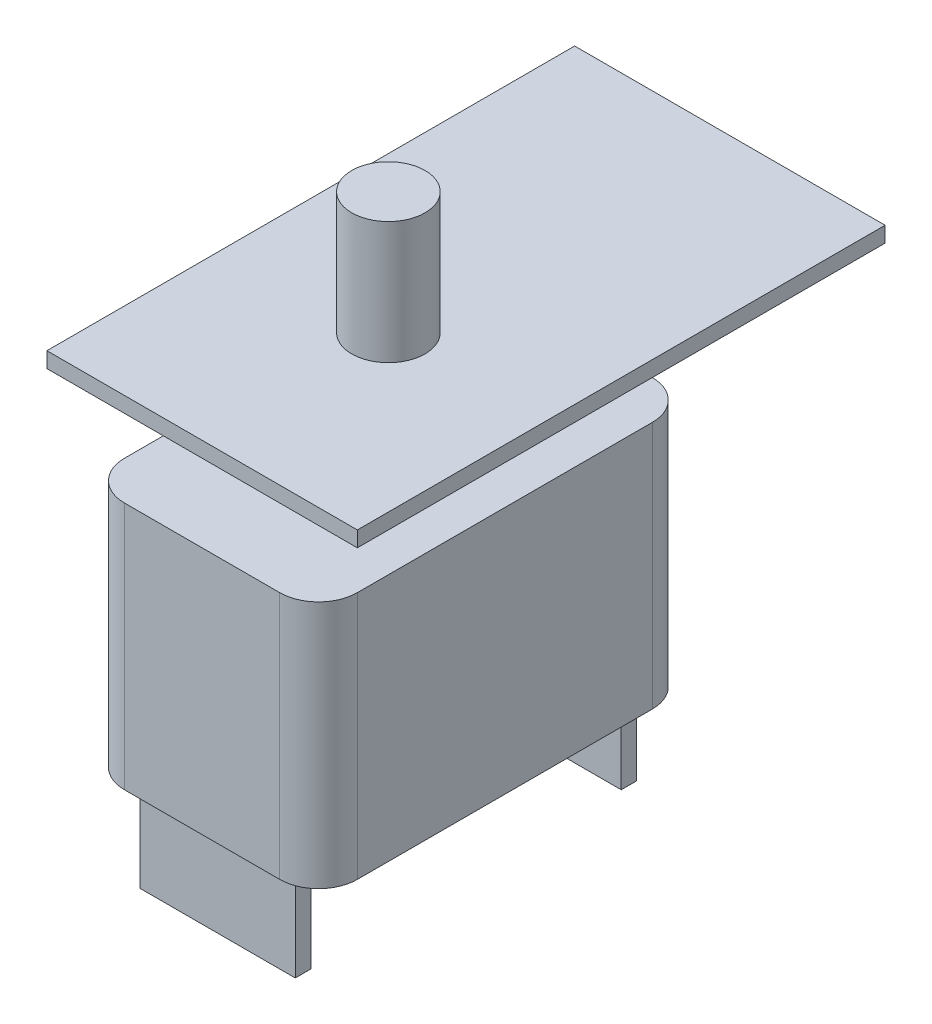
ISO-10303-21;
HEADER;
FILE_DESCRIPTION(('STEP AP214'),'2;1');
FILE_NAME('part.step','',(''),(''),'','','');
FILE_SCHEMA(('AUTOMOTIVE_DESIGN { 1 0 10303 214 1 1 1 1 }'));
ENDSEC;
DATA;
#1=APPLICATION_CONTEXT('core data for automotive mechanical design processes');
#2=APPLICATION_PROTOCOL_DEFINITION('international standard','automotive_design',2000,#1);
#3=PRODUCT_CONTEXT('',#1,'mechanical');
#4=PRODUCT('Part','Part','',(#3));
#5=PRODUCT_RELATED_PRODUCT_CATEGORY('part','',(#4));
#6=PRODUCT_DEFINITION_FORMATION('','',#4);
#7=PRODUCT_DEFINITION_CONTEXT('part definition',#1,'design');
#8=PRODUCT_DEFINITION('design','',#6,#7);
#9=PRODUCT_DEFINITION_SHAPE('','',#8);
#10=(LENGTH_UNIT() NAMED_UNIT(*) SI_UNIT(.MILLI.,.METRE.));
#11=(NAMED_UNIT(*) PLANE_ANGLE_UNIT() SI_UNIT($,.RADIAN.));
#12=(NAMED_UNIT(*) SI_UNIT($,.STERADIAN.) SOLID_ANGLE_UNIT());
#13=UNCERTAINTY_MEASURE_WITH_UNIT(LENGTH_MEASURE(1.E-05),#10,'distance_accuracy_value','');
#14=(GEOMETRIC_REPRESENTATION_CONTEXT(3) GLOBAL_UNCERTAINTY_ASSIGNED_CONTEXT((#13)) GLOBAL_UNIT_ASSIGNED_CONTEXT((#10,
#11,#12)) REPRESENTATION_CONTEXT('',''));
#15=CARTESIAN_POINT('',(0.,0.,0.));
#16=DIRECTION('',(0.,0.,1.));
#17=DIRECTION('',(1.,0.,0.));
#18=AXIS2_PLACEMENT_3D('',#15,#16,#17);
#19=CARTESIAN_POINT('',(0.,27.94,0.));
#20=DIRECTION('',(0.,-1.,0.));
#21=DIRECTION('',(0.,0.,-1.));
#22=AXIS2_PLACEMENT_3D('',#19,#20,#21);
#23=PLANE('',#22);
#24=DIRECTION('',(0.,0.,1.));
#25=VECTOR('',#24,1.);
#26=CARTESIAN_POINT('',(-12.7,27.94,-27.94));
#27=LINE('',#26,#25);
#28=CARTESIAN_POINT('',(-12.7,27.94,-27.94));
#29=VERTEX_POINT('',#28);
#30=CARTESIAN_POINT('',(-12.7,27.94,15.24));
#31=VERTEX_POINT('',#30);
#32=EDGE_CURVE('E179',#29,#31,#27,.T.);
#33=ORIENTED_EDGE('',*,*,#32,.T.);
#34=DIRECTION('',(1.,0.,0.));
#35=VECTOR('',#34,1.);
#36=CARTESIAN_POINT('',(12.7,27.94,15.24));
#37=LINE('',#36,#35);
#38=CARTESIAN_POINT('',(12.7,27.94,15.24));
#39=VERTEX_POINT('',#38);
#40=EDGE_CURVE('E168',#31,#39,#37,.T.);
#41=ORIENTED_EDGE('',*,*,#40,.T.);
#42=DIRECTION('',(0.,0.,-1.));
#43=VECTOR('',#42,1.);
#44=CARTESIAN_POINT('',(12.7,27.94,-27.94));
#45=LINE('',#44,#43);
#46=CARTESIAN_POINT('',(12.7,27.94,-27.94));
#47=VERTEX_POINT('',#46);
#48=EDGE_CURVE('E178',#39,#47,#45,.T.);
#49=ORIENTED_EDGE('',*,*,#48,.T.);
#50=DIRECTION('',(-1.,0.,0.));
#51=VECTOR('',#50,1.);
#52=CARTESIAN_POINT('',(12.7,27.94,-27.94));
#53=LINE('',#52,#51);
#54=EDGE_CURVE('E184',#47,#29,#53,.T.);
#55=ORIENTED_EDGE('',*,*,#54,.T.);
#56=EDGE_LOOP('',(#33,#41,#49,#55));
#57=FACE_BOUND('',#56,.T.);
#58=CARTESIAN_POINT('',(0.,27.94,0.));
#59=DIRECTION('',(0.,-1.,0.));
#60=DIRECTION('',(0.,0.,-1.));
#61=AXIS2_PLACEMENT_3D('',#58,#59,#60);
#62=CIRCLE('',#61,3.);
#63=CARTESIAN_POINT('',(0.,27.94,-3.));
#64=VERTEX_POINT('',#63);
#65=EDGE_CURVE('E11',#64,#64,#62,.F.);
#66=ORIENTED_EDGE('',*,*,#65,.F.);
#67=EDGE_LOOP('',(#66));
#68=FACE_BOUND('',#67,.T.);
#69=ADVANCED_FACE('F33',(#57,#68),#23,.F.);
#70=CARTESIAN_POINT('',(0.,0.,0.));
#71=DIRECTION('',(0.,1.,0.));
#72=DIRECTION('',(0.,0.,1.));
#73=AXIS2_PLACEMENT_3D('',#70,#71,#72);
#74=PLANE('',#73);
#75=DIRECTION('',(0.,0.,1.));
#76=VECTOR('',#75,1.);
#77=CARTESIAN_POINT('',(6.34999999999998,0.,13.97));
#78=LINE('',#77,#76);
#79=CARTESIAN_POINT('',(6.34999999999998,0.,12.7));
#80=VERTEX_POINT('',#79);
#81=CARTESIAN_POINT('',(6.34999999999998,0.,13.97));
#82=VERTEX_POINT('',#81);
#83=EDGE_CURVE('E226',#80,#82,#78,.T.);
#84=ORIENTED_EDGE('',*,*,#83,.F.);
#85=DIRECTION('',(1.,0.,0.));
#86=VECTOR('',#85,1.);
#87=CARTESIAN_POINT('',(-6.35000000000002,0.,12.7));
#88=LINE('',#87,#86);
#89=CARTESIAN_POINT('',(-6.35000000000002,0.,12.7));
#90=VERTEX_POINT('',#89);
#91=EDGE_CURVE('E231',#90,#80,#88,.T.);
#92=ORIENTED_EDGE('',*,*,#91,.F.);
#93=DIRECTION('',(0.,0.,-1.));
#94=VECTOR('',#93,1.);
#95=CARTESIAN_POINT('',(-6.35000000000002,0.,13.97));
#96=LINE('',#95,#94);
#97=CARTESIAN_POINT('',(-6.35000000000002,0.,13.97));
#98=VERTEX_POINT('',#97);
#99=EDGE_CURVE('E243',#98,#90,#96,.T.);
#100=ORIENTED_EDGE('',*,*,#99,.F.);
#101=DIRECTION('',(-1.,0.,0.));
#102=VECTOR('',#101,1.);
#103=CARTESIAN_POINT('',(-6.35000000000002,0.,13.97));
#104=LINE('',#103,#102);
#105=EDGE_CURVE('E240',#82,#98,#104,.T.);
#106=ORIENTED_EDGE('',*,*,#105,.F.);
#107=EDGE_LOOP('',(#84,#92,#100,#106));
#108=FACE_BOUND('',#107,.T.);
#109=DIRECTION('',(0.,0.,1.));
#110=VECTOR('',#109,1.);
#111=CARTESIAN_POINT('',(-9.525,0.,-15.24));
#112=LINE('',#111,#110);
#113=CARTESIAN_POINT('',(-9.525,0.,-12.065));
#114=VERTEX_POINT('',#113);
#115=CARTESIAN_POINT('',(-9.525,0.,12.065));
#116=VERTEX_POINT('',#115);
#117=EDGE_CURVE('E285',#114,#116,#112,.T.);
#118=ORIENTED_EDGE('',*,*,#117,.F.);
#119=CARTESIAN_POINT('',(-6.35,0.,-12.065));
#120=DIRECTION('',(0.,1.,0.));
#121=DIRECTION('',(0.,0.,1.));
#122=AXIS2_PLACEMENT_3D('',#119,#120,#121);
#123=CIRCLE('',#122,3.175);
#124=CARTESIAN_POINT('',(-6.35,0.,-15.24));
#125=VERTEX_POINT('',#124);
#126=EDGE_CURVE('E300',#114,#125,#123,.F.);
#127=ORIENTED_EDGE('',*,*,#126,.T.);
#128=DIRECTION('',(-1.,0.,0.));
#129=VECTOR('',#128,1.);
#130=CARTESIAN_POINT('',(-9.525,0.,-15.24));
#131=LINE('',#130,#129);
#132=CARTESIAN_POINT('',(6.34999999999999,0.,-15.24));
#133=VERTEX_POINT('',#132);
#134=EDGE_CURVE('E282',#133,#125,#131,.T.);
#135=ORIENTED_EDGE('',*,*,#134,.F.);
#136=CARTESIAN_POINT('',(6.35,0.,-12.065));
#137=DIRECTION('',(0.,1.,0.));
#138=DIRECTION('',(0.,0.,1.));
#139=AXIS2_PLACEMENT_3D('',#136,#137,#138);
#140=CIRCLE('',#139,3.175);
#141=CARTESIAN_POINT('',(9.525,0.,-12.065));
#142=VERTEX_POINT('',#141);
#143=EDGE_CURVE('E298',#133,#142,#140,.F.);
#144=ORIENTED_EDGE('',*,*,#143,.T.);
#145=DIRECTION('',(0.,0.,-1.));
#146=VECTOR('',#145,1.);
#147=CARTESIAN_POINT('',(9.525,0.,-15.24));
#148=LINE('',#147,#146);
#149=CARTESIAN_POINT('',(9.525,0.,12.065));
#150=VERTEX_POINT('',#149);
#151=EDGE_CURVE('E263',#150,#142,#148,.T.);
#152=ORIENTED_EDGE('',*,*,#151,.F.);
#153=CARTESIAN_POINT('',(6.35,0.,12.065));
#154=DIRECTION('',(0.,1.,0.));
#155=DIRECTION('',(0.,0.,1.));
#156=AXIS2_PLACEMENT_3D('',#153,#154,#155);
#157=CIRCLE('',#156,3.175);
#158=CARTESIAN_POINT('',(6.34999999999999,0.,15.24));
#159=VERTEX_POINT('',#158);
#160=EDGE_CURVE('E294',#150,#159,#157,.F.);
#161=ORIENTED_EDGE('',*,*,#160,.T.);
#162=DIRECTION('',(1.,0.,0.));
#163=VECTOR('',#162,1.);
#164=CARTESIAN_POINT('',(-9.525,0.,15.24));
#165=LINE('',#164,#163);
#166=CARTESIAN_POINT('',(-6.35,0.,15.24));
#167=VERTEX_POINT('',#166);
#168=EDGE_CURVE('E270',#167,#159,#165,.T.);
#169=ORIENTED_EDGE('',*,*,#168,.F.);
#170=CARTESIAN_POINT('',(-6.35,0.,12.065));
#171=DIRECTION('',(0.,1.,0.));
#172=DIRECTION('',(0.,0.,1.));
#173=AXIS2_PLACEMENT_3D('',#170,#171,#172);
#174=CIRCLE('',#173,3.175);
#175=EDGE_CURVE('E296',#167,#116,#174,.F.);
#176=ORIENTED_EDGE('',*,*,#175,.T.);
#177=EDGE_LOOP('',(#118,#127,#135,#144,#152,#161,#169,#176));
#178=FACE_BOUND('',#177,.T.);
#179=DIRECTION('',(0.,0.,-1.));
#180=VECTOR('',#179,1.);
#181=CARTESIAN_POINT('',(-6.35000000000002,0.,-13.97));
#182=LINE('',#181,#180);
#183=CARTESIAN_POINT('',(-6.35000000000002,0.,-12.7));
#184=VERTEX_POINT('',#183);
#185=CARTESIAN_POINT('',(-6.35000000000002,0.,-13.97));
#186=VERTEX_POINT('',#185);
#187=EDGE_CURVE('E193',#184,#186,#182,.T.);
#188=ORIENTED_EDGE('',*,*,#187,.F.);
#189=DIRECTION('',(-1.,0.,0.));
#190=VECTOR('',#189,1.);
#191=CARTESIAN_POINT('',(-6.35000000000002,0.,-12.7));
#192=LINE('',#191,#190);
#193=CARTESIAN_POINT('',(6.34999999999997,0.,-12.7));
#194=VERTEX_POINT('',#193);
#195=EDGE_CURVE('E205',#194,#184,#192,.T.);
#196=ORIENTED_EDGE('',*,*,#195,.F.);
#197=DIRECTION('',(0.,0.,1.));
#198=VECTOR('',#197,1.);
#199=CARTESIAN_POINT('',(6.34999999999997,0.,-13.97));
#200=LINE('',#199,#198);
#201=CARTESIAN_POINT('',(6.34999999999997,0.,-13.97));
#202=VERTEX_POINT('',#201);
#203=EDGE_CURVE('E53',#202,#194,#200,.T.);
#204=ORIENTED_EDGE('',*,*,#203,.F.);
#205=DIRECTION('',(1.,0.,0.));
#206=VECTOR('',#205,1.);
#207=CARTESIAN_POINT('',(-6.35000000000002,0.,-13.97));
#208=LINE('',#207,#206);
#209=EDGE_CURVE('E48',#186,#202,#208,.T.);
#210=ORIENTED_EDGE('',*,*,#209,.F.);
#211=EDGE_LOOP('',(#188,#196,#204,#210));
#212=FACE_BOUND('',#211,.T.);
#213=ADVANCED_FACE('F332',(#108,#178,#212),#74,.F.);
#214=CARTESIAN_POINT('',(0.,20.32,0.));
#215=DIRECTION('',(0.,1.,0.));
#216=DIRECTION('',(0.,0.,1.));
#217=AXIS2_PLACEMENT_3D('',#214,#215,#216);
#218=PLANE('',#217);
#219=DIRECTION('',(-1.,0.,0.));
#220=VECTOR('',#219,1.);
#221=CARTESIAN_POINT('',(-9.525,20.32,-15.24));
#222=LINE('',#221,#220);
#223=CARTESIAN_POINT('',(6.34999999999999,20.32,-15.24));
#224=VERTEX_POINT('',#223);
#225=CARTESIAN_POINT('',(-6.35,20.32,-15.24));
#226=VERTEX_POINT('',#225);
#227=EDGE_CURVE('E269',#224,#226,#222,.T.);
#228=ORIENTED_EDGE('',*,*,#227,.T.);
#229=CARTESIAN_POINT('',(-6.35,20.32,-12.065));
#230=DIRECTION('',(0.,1.,0.));
#231=DIRECTION('',(0.,0.,1.));
#232=AXIS2_PLACEMENT_3D('',#229,#230,#231);
#233=CIRCLE('',#232,3.175);
#234=CARTESIAN_POINT('',(-9.525,20.32,-12.065));
#235=VERTEX_POINT('',#234);
#236=EDGE_CURVE('E313',#226,#235,#233,.T.);
#237=ORIENTED_EDGE('',*,*,#236,.T.);
#238=DIRECTION('',(0.,0.,1.));
#239=VECTOR('',#238,1.);
#240=CARTESIAN_POINT('',(-9.525,20.32,-15.24));
#241=LINE('',#240,#239);
#242=CARTESIAN_POINT('',(-9.525,20.32,12.065));
#243=VERTEX_POINT('',#242);
#244=EDGE_CURVE('E273',#235,#243,#241,.T.);
#245=ORIENTED_EDGE('',*,*,#244,.T.);
#246=CARTESIAN_POINT('',(-6.35,20.32,12.065));
#247=DIRECTION('',(0.,1.,0.));
#248=DIRECTION('',(0.,0.,1.));
#249=AXIS2_PLACEMENT_3D('',#246,#247,#248);
#250=CIRCLE('',#249,3.175);
#251=CARTESIAN_POINT('',(-6.35,20.32,15.24));
#252=VERTEX_POINT('',#251);
#253=EDGE_CURVE('E309',#243,#252,#250,.T.);
#254=ORIENTED_EDGE('',*,*,#253,.T.);
#255=DIRECTION('',(1.,0.,0.));
#256=VECTOR('',#255,1.);
#257=CARTESIAN_POINT('',(-9.525,20.32,15.24));
#258=LINE('',#257,#256);
#259=CARTESIAN_POINT('',(6.34999999999999,20.32,15.24));
#260=VERTEX_POINT('',#259);
#261=EDGE_CURVE('E276',#252,#260,#258,.T.);
#262=ORIENTED_EDGE('',*,*,#261,.T.);
#263=CARTESIAN_POINT('',(6.35,20.32,12.065));
#264=DIRECTION('',(0.,1.,0.));
#265=DIRECTION('',(0.,0.,1.));
#266=AXIS2_PLACEMENT_3D('',#263,#264,#265);
#267=CIRCLE('',#266,3.175);
#268=CARTESIAN_POINT('',(9.525,20.32,12.065));
#269=VERTEX_POINT('',#268);
#270=EDGE_CURVE('E307',#260,#269,#267,.T.);
#271=ORIENTED_EDGE('',*,*,#270,.T.);
#272=DIRECTION('',(0.,0.,-1.));
#273=VECTOR('',#272,1.);
#274=CARTESIAN_POINT('',(9.525,20.32,-15.24));
#275=LINE('',#274,#273);
#276=CARTESIAN_POINT('',(9.525,20.32,-12.065));
#277=VERTEX_POINT('',#276);
#278=EDGE_CURVE('E266',#269,#277,#275,.T.);
#279=ORIENTED_EDGE('',*,*,#278,.T.);
#280=CARTESIAN_POINT('',(6.35,20.32,-12.065));
#281=DIRECTION('',(0.,1.,0.));
#282=DIRECTION('',(0.,0.,1.));
#283=AXIS2_PLACEMENT_3D('',#280,#281,#282);
#284=CIRCLE('',#283,3.175);
#285=EDGE_CURVE('E311',#277,#224,#284,.T.);
#286=ORIENTED_EDGE('',*,*,#285,.T.);
#287=EDGE_LOOP('',(#228,#237,#245,#254,#262,#271,#279,#286));
#288=FACE_BOUND('',#287,.T.);
#289=CARTESIAN_POINT('',(0.,20.32,0.));
#290=DIRECTION('',(0.,1.,0.));
#291=DIRECTION('',(0.,0.,1.));
#292=AXIS2_PLACEMENT_3D('',#289,#290,#291);
#293=CIRCLE('',#292,6.);
#294=CARTESIAN_POINT('',(0.,20.32,6.));
#295=VERTEX_POINT('',#294);
#296=EDGE_CURVE('E259',#295,#295,#293,.T.);
#297=ORIENTED_EDGE('',*,*,#296,.F.);
#298=EDGE_LOOP('',(#297));
#299=FACE_BOUND('',#298,.T.);
#300=ADVANCED_FACE('F343',(#288,#299),#218,.T.);
#301=CARTESIAN_POINT('',(9.525,20.32,-15.24));
#302=DIRECTION('',(-1.,0.,0.));
#303=DIRECTION('',(0.,0.,1.));
#304=AXIS2_PLACEMENT_3D('',#301,#302,#303);
#305=PLANE('',#304);
#306=ORIENTED_EDGE('',*,*,#151,.T.);
#307=DIRECTION('',(0.,-1.,0.));
#308=VECTOR('',#307,1.);
#309=CARTESIAN_POINT('',(9.525,20.32,-12.065));
#310=LINE('',#309,#308);
#311=EDGE_CURVE('E318',#142,#277,#310,.F.);
#312=ORIENTED_EDGE('',*,*,#311,.T.);
#313=ORIENTED_EDGE('',*,*,#278,.F.);
#314=DIRECTION('',(0.,-1.,0.));
#315=VECTOR('',#314,1.);
#316=CARTESIAN_POINT('',(9.525,20.32,12.065));
#317=LINE('',#316,#315);
#318=EDGE_CURVE('E315',#269,#150,#317,.T.);
#319=ORIENTED_EDGE('',*,*,#318,.T.);
#320=EDGE_LOOP('',(#306,#312,#313,#319));
#321=FACE_BOUND('',#320,.T.);
#322=ADVANCED_FACE('F339',(#321),#305,.F.);
#323=CARTESIAN_POINT('',(-9.525,20.32,-15.24));
#324=DIRECTION('',(0.,0.,1.));
#325=DIRECTION('',(1.,0.,0.));
#326=AXIS2_PLACEMENT_3D('',#323,#324,#325);
#327=PLANE('',#326);
#328=ORIENTED_EDGE('',*,*,#134,.T.);
#329=DIRECTION('',(0.,-1.,0.));
#330=VECTOR('',#329,1.);
#331=CARTESIAN_POINT('',(-6.35,20.32,-15.24));
#332=LINE('',#331,#330);
#333=EDGE_CURVE('E305',#125,#226,#332,.F.);
#334=ORIENTED_EDGE('',*,*,#333,.T.);
#335=ORIENTED_EDGE('',*,*,#227,.F.);
#336=DIRECTION('',(0.,-1.,0.));
#337=VECTOR('',#336,1.);
#338=CARTESIAN_POINT('',(6.35,20.32,-15.24));
#339=LINE('',#338,#337);
#340=EDGE_CURVE('E302',#224,#133,#339,.T.);
#341=ORIENTED_EDGE('',*,*,#340,.T.);
#342=EDGE_LOOP('',(#328,#334,#335,#341));
#343=FACE_BOUND('',#342,.T.);
#344=ADVANCED_FACE('F351',(#343),#327,.F.);
#345=CARTESIAN_POINT('',(-9.525,20.32,-15.24));
#346=DIRECTION('',(1.,0.,0.));
#347=DIRECTION('',(0.,0.,-1.));
#348=AXIS2_PLACEMENT_3D('',#345,#346,#347);
#349=PLANE('',#348);
#350=ORIENTED_EDGE('',*,*,#244,.F.);
#351=DIRECTION('',(0.,-1.,0.));
#352=VECTOR('',#351,1.);
#353=CARTESIAN_POINT('',(-9.525,20.32,-12.065));
#354=LINE('',#353,#352);
#355=EDGE_CURVE('E291',#235,#114,#354,.T.);
#356=ORIENTED_EDGE('',*,*,#355,.T.);
#357=ORIENTED_EDGE('',*,*,#117,.T.);
#358=DIRECTION('',(0.,-1.,0.));
#359=VECTOR('',#358,1.);
#360=CARTESIAN_POINT('',(-9.525,20.32,12.065));
#361=LINE('',#360,#359);
#362=EDGE_CURVE('E279',#116,#243,#361,.F.);
#363=ORIENTED_EDGE('',*,*,#362,.T.);
#364=EDGE_LOOP('',(#350,#356,#357,#363));
#365=FACE_BOUND('',#364,.T.);
#366=ADVANCED_FACE('F359',(#365),#349,.F.);
#367=CARTESIAN_POINT('',(-9.525,20.32,15.24));
#368=DIRECTION('',(0.,0.,-1.));
#369=DIRECTION('',(-1.,0.,0.));
#370=AXIS2_PLACEMENT_3D('',#367,#368,#369);
#371=PLANE('',#370);
#372=ORIENTED_EDGE('',*,*,#261,.F.);
#373=DIRECTION('',(0.,-1.,0.));
#374=VECTOR('',#373,1.);
#375=CARTESIAN_POINT('',(-6.35,20.32,15.24));
#376=LINE('',#375,#374);
#377=EDGE_CURVE('E41',#252,#167,#376,.T.);
#378=ORIENTED_EDGE('',*,*,#377,.T.);
#379=ORIENTED_EDGE('',*,*,#168,.T.);
#380=DIRECTION('',(0.,-1.,0.));
#381=VECTOR('',#380,1.);
#382=CARTESIAN_POINT('',(6.35,20.32,15.24));
#383=LINE('',#382,#381);
#384=EDGE_CURVE('E320',#159,#260,#383,.F.);
#385=ORIENTED_EDGE('',*,*,#384,.T.);
#386=EDGE_LOOP('',(#372,#378,#379,#385));
#387=FACE_BOUND('',#386,.T.);
#388=ADVANCED_FACE('F326',(#387),#371,.F.);
#389=CARTESIAN_POINT('',(-6.35,20.32,-12.065));
#390=DIRECTION('',(0.,-1.,0.));
#391=DIRECTION('',(0.,0.,-1.));
#392=AXIS2_PLACEMENT_3D('',#389,#390,#391);
#393=CYLINDRICAL_SURFACE('',#392,3.175);
#394=ORIENTED_EDGE('',*,*,#236,.F.);
#395=ORIENTED_EDGE('',*,*,#333,.F.);
#396=ORIENTED_EDGE('',*,*,#126,.F.);
#397=ORIENTED_EDGE('',*,*,#355,.F.);
#398=EDGE_LOOP('',(#394,#395,#396,#397));
#399=FACE_BOUND('',#398,.T.);
#400=ADVANCED_FACE('F356',(#399),#393,.T.);
#401=CARTESIAN_POINT('',(6.35,20.32,-12.065));
#402=DIRECTION('',(0.,-1.,0.));
#403=DIRECTION('',(0.,0.,-1.));
#404=AXIS2_PLACEMENT_3D('',#401,#402,#403);
#405=CYLINDRICAL_SURFACE('',#404,3.175);
#406=ORIENTED_EDGE('',*,*,#285,.F.);
#407=ORIENTED_EDGE('',*,*,#311,.F.);
#408=ORIENTED_EDGE('',*,*,#143,.F.);
#409=ORIENTED_EDGE('',*,*,#340,.F.);
#410=EDGE_LOOP('',(#406,#407,#408,#409));
#411=FACE_BOUND('',#410,.T.);
#412=ADVANCED_FACE('F348',(#411),#405,.T.);
#413=CARTESIAN_POINT('',(-6.35,20.32,12.065));
#414=DIRECTION('',(0.,-1.,0.));
#415=DIRECTION('',(0.,0.,-1.));
#416=AXIS2_PLACEMENT_3D('',#413,#414,#415);
#417=CYLINDRICAL_SURFACE('',#416,3.175);
#418=ORIENTED_EDGE('',*,*,#253,.F.);
#419=ORIENTED_EDGE('',*,*,#362,.F.);
#420=ORIENTED_EDGE('',*,*,#175,.F.);
#421=ORIENTED_EDGE('',*,*,#377,.F.);
#422=EDGE_LOOP('',(#418,#419,#420,#421));
#423=FACE_BOUND('',#422,.T.);
#424=ADVANCED_FACE('F361',(#423),#417,.T.);
#425=CARTESIAN_POINT('',(6.35,20.32,12.065));
#426=DIRECTION('',(0.,-1.,0.));
#427=DIRECTION('',(0.,0.,-1.));
#428=AXIS2_PLACEMENT_3D('',#425,#426,#427);
#429=CYLINDRICAL_SURFACE('',#428,3.175);
#430=ORIENTED_EDGE('',*,*,#270,.F.);
#431=ORIENTED_EDGE('',*,*,#384,.F.);
#432=ORIENTED_EDGE('',*,*,#160,.F.);
#433=ORIENTED_EDGE('',*,*,#318,.F.);
#434=EDGE_LOOP('',(#430,#431,#432,#433));
#435=FACE_BOUND('',#434,.T.);
#436=ADVANCED_FACE('F35',(#435),#429,.T.);
#437=CARTESIAN_POINT('',(0.,26.67,0.));
#438=DIRECTION('',(0.,-1.,0.));
#439=DIRECTION('',(0.,0.,-1.));
#440=AXIS2_PLACEMENT_3D('',#437,#438,#439);
#441=CYLINDRICAL_SURFACE('',#440,6.);
#442=CARTESIAN_POINT('',(0.,26.67,0.));
#443=DIRECTION('',(0.,1.,0.));
#444=DIRECTION('',(0.,0.,1.));
#445=AXIS2_PLACEMENT_3D('',#442,#443,#444);
#446=CIRCLE('',#445,6.);
#447=CARTESIAN_POINT('',(0.,26.67,6.));
#448=VERTEX_POINT('',#447);
#449=EDGE_CURVE('E260',#448,#448,#446,.T.);
#450=ORIENTED_EDGE('',*,*,#449,.F.);
#451=EDGE_LOOP('',(#450));
#452=FACE_BOUND('',#451,.T.);
#453=ORIENTED_EDGE('',*,*,#296,.T.);
#454=EDGE_LOOP('',(#453));
#455=FACE_BOUND('',#454,.T.);
#456=ADVANCED_FACE('F367',(#452,#455),#441,.T.);
#457=CARTESIAN_POINT('',(6.34999999999998,-7.62,13.97));
#458=DIRECTION('',(-1.,0.,0.));
#459=DIRECTION('',(0.,0.,1.));
#460=AXIS2_PLACEMENT_3D('',#457,#458,#459);
#461=PLANE('',#460);
#462=ORIENTED_EDGE('',*,*,#83,.T.);
#463=DIRECTION('',(0.,1.,0.));
#464=VECTOR('',#463,1.);
#465=CARTESIAN_POINT('',(6.34999999999998,-7.62,13.97));
#466=LINE('',#465,#464);
#467=CARTESIAN_POINT('',(6.34999999999998,-7.62,13.97));
#468=VERTEX_POINT('',#467);
#469=EDGE_CURVE('E256',#468,#82,#466,.T.);
#470=ORIENTED_EDGE('',*,*,#469,.F.);
#471=DIRECTION('',(0.,0.,1.));
#472=VECTOR('',#471,1.);
#473=CARTESIAN_POINT('',(6.34999999999998,-7.62,13.97));
#474=LINE('',#473,#472);
#475=CARTESIAN_POINT('',(6.34999999999998,-7.62,12.7));
#476=VERTEX_POINT('',#475);
#477=EDGE_CURVE('E227',#476,#468,#474,.T.);
#478=ORIENTED_EDGE('',*,*,#477,.F.);
#479=DIRECTION('',(0.,1.,0.));
#480=VECTOR('',#479,1.);
#481=CARTESIAN_POINT('',(6.34999999999998,-7.62,12.7));
#482=LINE('',#481,#480);
#483=EDGE_CURVE('E237',#476,#80,#482,.T.);
#484=ORIENTED_EDGE('',*,*,#483,.T.);
#485=EDGE_LOOP('',(#462,#470,#478,#484));
#486=FACE_BOUND('',#485,.T.);
#487=ADVANCED_FACE('F431',(#486),#461,.F.);
#488=CARTESIAN_POINT('',(-6.35000000000002,-7.62,13.97));
#489=DIRECTION('',(0.,0.,-1.));
#490=DIRECTION('',(-1.,0.,0.));
#491=AXIS2_PLACEMENT_3D('',#488,#489,#490);
#492=PLANE('',#491);
#493=ORIENTED_EDGE('',*,*,#105,.T.);
#494=DIRECTION('',(0.,1.,0.));
#495=VECTOR('',#494,1.);
#496=CARTESIAN_POINT('',(-6.35000000000002,-7.62,13.97));
#497=LINE('',#496,#495);
#498=CARTESIAN_POINT('',(-6.35000000000002,-7.62,13.97));
#499=VERTEX_POINT('',#498);
#500=EDGE_CURVE('E253',#499,#98,#497,.T.);
#501=ORIENTED_EDGE('',*,*,#500,.F.);
#502=DIRECTION('',(-1.,0.,0.));
#503=VECTOR('',#502,1.);
#504=CARTESIAN_POINT('',(-6.35000000000002,-7.62,13.97));
#505=LINE('',#504,#503);
#506=EDGE_CURVE('E230',#468,#499,#505,.T.);
#507=ORIENTED_EDGE('',*,*,#506,.F.);
#508=ORIENTED_EDGE('',*,*,#469,.T.);
#509=EDGE_LOOP('',(#493,#501,#507,#508));
#510=FACE_BOUND('',#509,.T.);
#511=ADVANCED_FACE('F427',(#510),#492,.F.);
#512=CARTESIAN_POINT('',(-6.35000000000002,-7.62,13.97));
#513=DIRECTION('',(1.,0.,0.));
#514=DIRECTION('',(0.,0.,-1.));
#515=AXIS2_PLACEMENT_3D('',#512,#513,#514);
#516=PLANE('',#515);
#517=ORIENTED_EDGE('',*,*,#99,.T.);
#518=DIRECTION('',(0.,1.,0.));
#519=VECTOR('',#518,1.);
#520=CARTESIAN_POINT('',(-6.35000000000002,-7.62,12.7));
#521=LINE('',#520,#519);
#522=CARTESIAN_POINT('',(-6.35000000000002,-7.62,12.7));
#523=VERTEX_POINT('',#522);
#524=EDGE_CURVE('E250',#523,#90,#521,.T.);
#525=ORIENTED_EDGE('',*,*,#524,.F.);
#526=DIRECTION('',(0.,0.,-1.));
#527=VECTOR('',#526,1.);
#528=CARTESIAN_POINT('',(-6.35000000000002,-7.62,13.97));
#529=LINE('',#528,#527);
#530=EDGE_CURVE('E233',#499,#523,#529,.T.);
#531=ORIENTED_EDGE('',*,*,#530,.F.);
#532=ORIENTED_EDGE('',*,*,#500,.T.);
#533=EDGE_LOOP('',(#517,#525,#531,#532));
#534=FACE_BOUND('',#533,.T.);
#535=ADVANCED_FACE('F423',(#534),#516,.F.);
#536=CARTESIAN_POINT('',(-6.35000000000002,-7.62,12.7));
#537=DIRECTION('',(0.,0.,1.));
#538=DIRECTION('',(1.,0.,0.));
#539=AXIS2_PLACEMENT_3D('',#536,#537,#538);
#540=PLANE('',#539);
#541=ORIENTED_EDGE('',*,*,#91,.T.);
#542=ORIENTED_EDGE('',*,*,#483,.F.);
#543=DIRECTION('',(1.,0.,0.));
#544=VECTOR('',#543,1.);
#545=CARTESIAN_POINT('',(-6.35000000000002,-7.62,12.7));
#546=LINE('',#545,#544);
#547=EDGE_CURVE('E235',#523,#476,#546,.T.);
#548=ORIENTED_EDGE('',*,*,#547,.F.);
#549=ORIENTED_EDGE('',*,*,#524,.T.);
#550=EDGE_LOOP('',(#541,#542,#548,#549));
#551=FACE_BOUND('',#550,.T.);
#552=ADVANCED_FACE('F419',(#551),#540,.F.);
#553=CARTESIAN_POINT('',(0.,-7.62,0.));
#554=DIRECTION('',(0.,-1.,0.));
#555=DIRECTION('',(0.,0.,-1.));
#556=AXIS2_PLACEMENT_3D('',#553,#554,#555);
#557=PLANE('',#556);
#558=ORIENTED_EDGE('',*,*,#477,.T.);
#559=ORIENTED_EDGE('',*,*,#506,.T.);
#560=ORIENTED_EDGE('',*,*,#530,.T.);
#561=ORIENTED_EDGE('',*,*,#547,.T.);
#562=EDGE_LOOP('',(#558,#559,#560,#561));
#563=FACE_BOUND('',#562,.T.);
#564=ADVANCED_FACE('F415',(#563),#557,.T.);
#565=CARTESIAN_POINT('',(-6.35000000000002,-7.62,-13.97));
#566=DIRECTION('',(1.,0.,0.));
#567=DIRECTION('',(0.,0.,-1.));
#568=AXIS2_PLACEMENT_3D('',#565,#566,#567);
#569=PLANE('',#568);
#570=ORIENTED_EDGE('',*,*,#187,.T.);
#571=DIRECTION('',(0.,1.,0.));
#572=VECTOR('',#571,1.);
#573=CARTESIAN_POINT('',(-6.35000000000002,-7.62,-13.97));
#574=LINE('',#573,#572);
#575=CARTESIAN_POINT('',(-6.35000000000002,-7.62,-13.97));
#576=VERTEX_POINT('',#575);
#577=EDGE_CURVE('E224',#576,#186,#574,.T.);
#578=ORIENTED_EDGE('',*,*,#577,.F.);
#579=DIRECTION('',(0.,0.,-1.));
#580=VECTOR('',#579,1.);
#581=CARTESIAN_POINT('',(-6.35000000000002,-7.62,-13.97));
#582=LINE('',#581,#580);
#583=CARTESIAN_POINT('',(-6.35000000000002,-7.62,-12.7));
#584=VERTEX_POINT('',#583);
#585=EDGE_CURVE('E201',#584,#576,#582,.T.);
#586=ORIENTED_EDGE('',*,*,#585,.F.);
#587=DIRECTION('',(0.,1.,0.));
#588=VECTOR('',#587,1.);
#589=CARTESIAN_POINT('',(-6.35000000000002,-7.62,-12.7));
#590=LINE('',#589,#588);
#591=EDGE_CURVE('E210',#584,#184,#590,.T.);
#592=ORIENTED_EDGE('',*,*,#591,.T.);
#593=EDGE_LOOP('',(#570,#578,#586,#592));
#594=FACE_BOUND('',#593,.T.);
#595=ADVANCED_FACE('F411',(#594),#569,.F.);
#596=CARTESIAN_POINT('',(-6.35000000000002,-7.62,-13.97));
#597=DIRECTION('',(0.,0.,1.));
#598=DIRECTION('',(1.,0.,0.));
#599=AXIS2_PLACEMENT_3D('',#596,#597,#598);
#600=PLANE('',#599);
#601=ORIENTED_EDGE('',*,*,#209,.T.);
#602=DIRECTION('',(0.,1.,0.));
#603=VECTOR('',#602,1.);
#604=CARTESIAN_POINT('',(6.34999999999997,-7.62,-13.97));
#605=LINE('',#604,#603);
#606=CARTESIAN_POINT('',(6.34999999999997,-7.62,-13.97));
#607=VERTEX_POINT('',#606);
#608=EDGE_CURVE('E221',#607,#202,#605,.T.);
#609=ORIENTED_EDGE('',*,*,#608,.F.);
#610=DIRECTION('',(1.,0.,0.));
#611=VECTOR('',#610,1.);
#612=CARTESIAN_POINT('',(-6.35000000000002,-7.62,-13.97));
#613=LINE('',#612,#611);
#614=EDGE_CURVE('E204',#576,#607,#613,.T.);
#615=ORIENTED_EDGE('',*,*,#614,.F.);
#616=ORIENTED_EDGE('',*,*,#577,.T.);
#617=EDGE_LOOP('',(#601,#609,#615,#616));
#618=FACE_BOUND('',#617,.T.);
#619=ADVANCED_FACE('F407',(#618),#600,.F.);
#620=CARTESIAN_POINT('',(6.34999999999997,-7.62,-13.97));
#621=DIRECTION('',(-1.,0.,0.));
#622=DIRECTION('',(0.,0.,1.));
#623=AXIS2_PLACEMENT_3D('',#620,#621,#622);
#624=PLANE('',#623);
#625=ORIENTED_EDGE('',*,*,#203,.T.);
#626=DIRECTION('',(0.,1.,0.));
#627=VECTOR('',#626,1.);
#628=CARTESIAN_POINT('',(6.34999999999997,-7.62,-12.7));
#629=LINE('',#628,#627);
#630=CARTESIAN_POINT('',(6.34999999999997,-7.62,-12.7));
#631=VERTEX_POINT('',#630);
#632=EDGE_CURVE('E218',#631,#194,#629,.T.);
#633=ORIENTED_EDGE('',*,*,#632,.F.);
#634=DIRECTION('',(0.,0.,1.));
#635=VECTOR('',#634,1.);
#636=CARTESIAN_POINT('',(6.34999999999997,-7.62,-13.97));
#637=LINE('',#636,#635);
#638=EDGE_CURVE('E207',#607,#631,#637,.T.);
#639=ORIENTED_EDGE('',*,*,#638,.F.);
#640=ORIENTED_EDGE('',*,*,#608,.T.);
#641=EDGE_LOOP('',(#625,#633,#639,#640));
#642=FACE_BOUND('',#641,.T.);
#643=ADVANCED_FACE('F403',(#642),#624,.F.);
#644=CARTESIAN_POINT('',(-6.35000000000002,-7.62,-12.7));
#645=DIRECTION('',(0.,0.,-1.));
#646=DIRECTION('',(-1.,0.,0.));
#647=AXIS2_PLACEMENT_3D('',#644,#645,#646);
#648=PLANE('',#647);
#649=ORIENTED_EDGE('',*,*,#195,.T.);
#650=ORIENTED_EDGE('',*,*,#591,.F.);
#651=DIRECTION('',(-1.,0.,0.));
#652=VECTOR('',#651,1.);
#653=CARTESIAN_POINT('',(-6.35000000000002,-7.62,-12.7));
#654=LINE('',#653,#652);
#655=EDGE_CURVE('E209',#631,#584,#654,.T.);
#656=ORIENTED_EDGE('',*,*,#655,.F.);
#657=ORIENTED_EDGE('',*,*,#632,.T.);
#658=EDGE_LOOP('',(#649,#650,#656,#657));
#659=FACE_BOUND('',#658,.T.);
#660=ADVANCED_FACE('F399',(#659),#648,.F.);
#661=CARTESIAN_POINT('',(0.,-7.62,0.));
#662=DIRECTION('',(0.,1.,0.));
#663=DIRECTION('',(0.,0.,1.));
#664=AXIS2_PLACEMENT_3D('',#661,#662,#663);
#665=PLANE('',#664);
#666=ORIENTED_EDGE('',*,*,#585,.T.);
#667=ORIENTED_EDGE('',*,*,#614,.T.);
#668=ORIENTED_EDGE('',*,*,#638,.T.);
#669=ORIENTED_EDGE('',*,*,#655,.T.);
#670=EDGE_LOOP('',(#666,#667,#668,#669));
#671=FACE_BOUND('',#670,.T.);
#672=ADVANCED_FACE('F383',(#671),#665,.F.);
#673=CARTESIAN_POINT('',(0.,26.67,0.));
#674=DIRECTION('',(0.,-1.,0.));
#675=DIRECTION('',(0.,0.,-1.));
#676=AXIS2_PLACEMENT_3D('',#673,#674,#675);
#677=PLANE('',#676);
#678=DIRECTION('',(0.,0.,1.));
#679=VECTOR('',#678,1.);
#680=CARTESIAN_POINT('',(-12.7,26.67,-27.94));
#681=LINE('',#680,#679);
#682=CARTESIAN_POINT('',(-12.7,26.67,-27.94));
#683=VERTEX_POINT('',#682);
#684=CARTESIAN_POINT('',(-12.7,26.67,15.24));
#685=VERTEX_POINT('',#684);
#686=EDGE_CURVE('E192',#683,#685,#681,.T.);
#687=ORIENTED_EDGE('',*,*,#686,.F.);
#688=DIRECTION('',(-1.,0.,0.));
#689=VECTOR('',#688,1.);
#690=CARTESIAN_POINT('',(12.7,26.67,-27.94));
#691=LINE('',#690,#689);
#692=CARTESIAN_POINT('',(12.7,26.67,-27.94));
#693=VERTEX_POINT('',#692);
#694=EDGE_CURVE('E188',#693,#683,#691,.T.);
#695=ORIENTED_EDGE('',*,*,#694,.F.);
#696=DIRECTION('',(0.,0.,-1.));
#697=VECTOR('',#696,1.);
#698=CARTESIAN_POINT('',(12.7,26.67,-27.94));
#699=LINE('',#698,#697);
#700=CARTESIAN_POINT('',(12.7,26.67,15.24));
#701=VERTEX_POINT('',#700);
#702=EDGE_CURVE('E612',#701,#693,#699,.T.);
#703=ORIENTED_EDGE('',*,*,#702,.F.);
#704=DIRECTION('',(1.,0.,0.));
#705=VECTOR('',#704,1.);
#706=CARTESIAN_POINT('',(12.7,26.67,15.24));
#707=LINE('',#706,#705);
#708=EDGE_CURVE('E605',#685,#701,#707,.T.);
#709=ORIENTED_EDGE('',*,*,#708,.F.);
#710=EDGE_LOOP('',(#687,#695,#703,#709));
#711=FACE_BOUND('',#710,.T.);
#712=ORIENTED_EDGE('',*,*,#449,.T.);
#713=EDGE_LOOP('',(#712));
#714=FACE_BOUND('',#713,.T.);
#715=ADVANCED_FACE('F380',(#711,#714),#677,.T.);
#716=CARTESIAN_POINT('',(-12.7,27.94,-27.94));
#717=DIRECTION('',(1.,0.,0.));
#718=DIRECTION('',(0.,0.,-1.));
#719=AXIS2_PLACEMENT_3D('',#716,#717,#718);
#720=PLANE('',#719);
#721=ORIENTED_EDGE('',*,*,#686,.T.);
#722=DIRECTION('',(0.,-1.,0.));
#723=VECTOR('',#722,1.);
#724=CARTESIAN_POINT('',(-12.7,27.94,15.24));
#725=LINE('',#724,#723);
#726=EDGE_CURVE('E172',#31,#685,#725,.T.);
#727=ORIENTED_EDGE('',*,*,#726,.F.);
#728=ORIENTED_EDGE('',*,*,#32,.F.);
#729=DIRECTION('',(0.,-1.,0.));
#730=VECTOR('',#729,1.);
#731=CARTESIAN_POINT('',(-12.7,27.94,-27.94));
#732=LINE('',#731,#730);
#733=EDGE_CURVE('E609',#29,#683,#732,.T.);
#734=ORIENTED_EDGE('',*,*,#733,.T.);
#735=EDGE_LOOP('',(#721,#727,#728,#734));
#736=FACE_BOUND('',#735,.T.);
#737=ADVANCED_FACE('F190',(#736),#720,.F.);
#738=CARTESIAN_POINT('',(12.7,27.94,15.24));
#739=DIRECTION('',(0.,0.,-1.));
#740=DIRECTION('',(-1.,0.,0.));
#741=AXIS2_PLACEMENT_3D('',#738,#739,#740);
#742=PLANE('',#741);
#743=ORIENTED_EDGE('',*,*,#708,.T.);
#744=DIRECTION('',(0.,-1.,0.));
#745=VECTOR('',#744,1.);
#746=CARTESIAN_POINT('',(12.7,27.94,15.24));
#747=LINE('',#746,#745);
#748=EDGE_CURVE('E175',#39,#701,#747,.T.);
#749=ORIENTED_EDGE('',*,*,#748,.F.);
#750=ORIENTED_EDGE('',*,*,#40,.F.);
#751=ORIENTED_EDGE('',*,*,#726,.T.);
#752=EDGE_LOOP('',(#743,#749,#750,#751));
#753=FACE_BOUND('',#752,.T.);
#754=ADVANCED_FACE('F170',(#753),#742,.F.);
#755=CARTESIAN_POINT('',(12.7,27.94,-27.94));
#756=DIRECTION('',(-1.,0.,0.));
#757=DIRECTION('',(0.,0.,1.));
#758=AXIS2_PLACEMENT_3D('',#755,#756,#757);
#759=PLANE('',#758);
#760=ORIENTED_EDGE('',*,*,#702,.T.);
#761=DIRECTION('',(0.,-1.,0.));
#762=VECTOR('',#761,1.);
#763=CARTESIAN_POINT('',(12.7,27.94,-27.94));
#764=LINE('',#763,#762);
#765=EDGE_CURVE('E197',#47,#693,#764,.T.);
#766=ORIENTED_EDGE('',*,*,#765,.F.);
#767=ORIENTED_EDGE('',*,*,#48,.F.);
#768=ORIENTED_EDGE('',*,*,#748,.T.);
#769=EDGE_LOOP('',(#760,#766,#767,#768));
#770=FACE_BOUND('',#769,.T.);
#771=ADVANCED_FACE('F388',(#770),#759,.F.);
#772=CARTESIAN_POINT('',(12.7,27.94,-27.94));
#773=DIRECTION('',(0.,0.,1.));
#774=DIRECTION('',(1.,0.,0.));
#775=AXIS2_PLACEMENT_3D('',#772,#773,#774);
#776=PLANE('',#775);
#777=ORIENTED_EDGE('',*,*,#694,.T.);
#778=ORIENTED_EDGE('',*,*,#733,.F.);
#779=ORIENTED_EDGE('',*,*,#54,.F.);
#780=ORIENTED_EDGE('',*,*,#765,.T.);
#781=EDGE_LOOP('',(#777,#778,#779,#780));
#782=FACE_BOUND('',#781,.T.);
#783=ADVANCED_FACE('F385',(#782),#776,.F.);
#784=CARTESIAN_POINT('',(0.,37.94,0.));
#785=DIRECTION('',(0.,-1.,0.));
#786=DIRECTION('',(0.,0.,-1.));
#787=AXIS2_PLACEMENT_3D('',#784,#785,#786);
#788=CYLINDRICAL_SURFACE('',#787,3.);
#789=CARTESIAN_POINT('',(0.,37.94,0.));
#790=DIRECTION('',(0.,1.,0.));
#791=DIRECTION('',(0.,0.,1.));
#792=AXIS2_PLACEMENT_3D('',#789,#790,#791);
#793=CIRCLE('',#792,3.);
#794=CARTESIAN_POINT('',(0.,37.94,3.));
#795=VERTEX_POINT('',#794);
#796=EDGE_CURVE('E603',#795,#795,#793,.T.);
#797=ORIENTED_EDGE('',*,*,#796,.F.);
#798=EDGE_LOOP('',(#797));
#799=FACE_BOUND('',#798,.T.);
#800=ORIENTED_EDGE('',*,*,#65,.T.);
#801=EDGE_LOOP('',(#800));
#802=FACE_BOUND('',#801,.T.);
#803=ADVANCED_FACE('F378',(#799,#802),#788,.T.);
#804=CARTESIAN_POINT('',(0.,37.94,0.));
#805=DIRECTION('',(0.,1.,0.));
#806=DIRECTION('',(0.,0.,1.));
#807=AXIS2_PLACEMENT_3D('',#804,#805,#806);
#808=PLANE('',#807);
#809=ORIENTED_EDGE('',*,*,#796,.T.);
#810=EDGE_LOOP('',(#809));
#811=FACE_BOUND('',#810,.T.);
#812=ADVANCED_FACE('F589',(#811),#808,.T.);
#813=CLOSED_SHELL('',(#69,#213,#300,#322,#344,#366,#388,#400,#412,#424,#436,#456,#487,#511,#535,
#552,#564,#595,#619,#643,#660,#672,#715,#737,#754,#771,#783,#803,#812));
#814=MANIFOLD_SOLID_BREP('B2',#813);
#815=ADVANCED_BREP_SHAPE_REPRESENTATION('',(#18,#814),#14);
#816=SHAPE_DEFINITION_REPRESENTATION(#9,#815);
ENDSEC;
END-ISO-10303-21;
